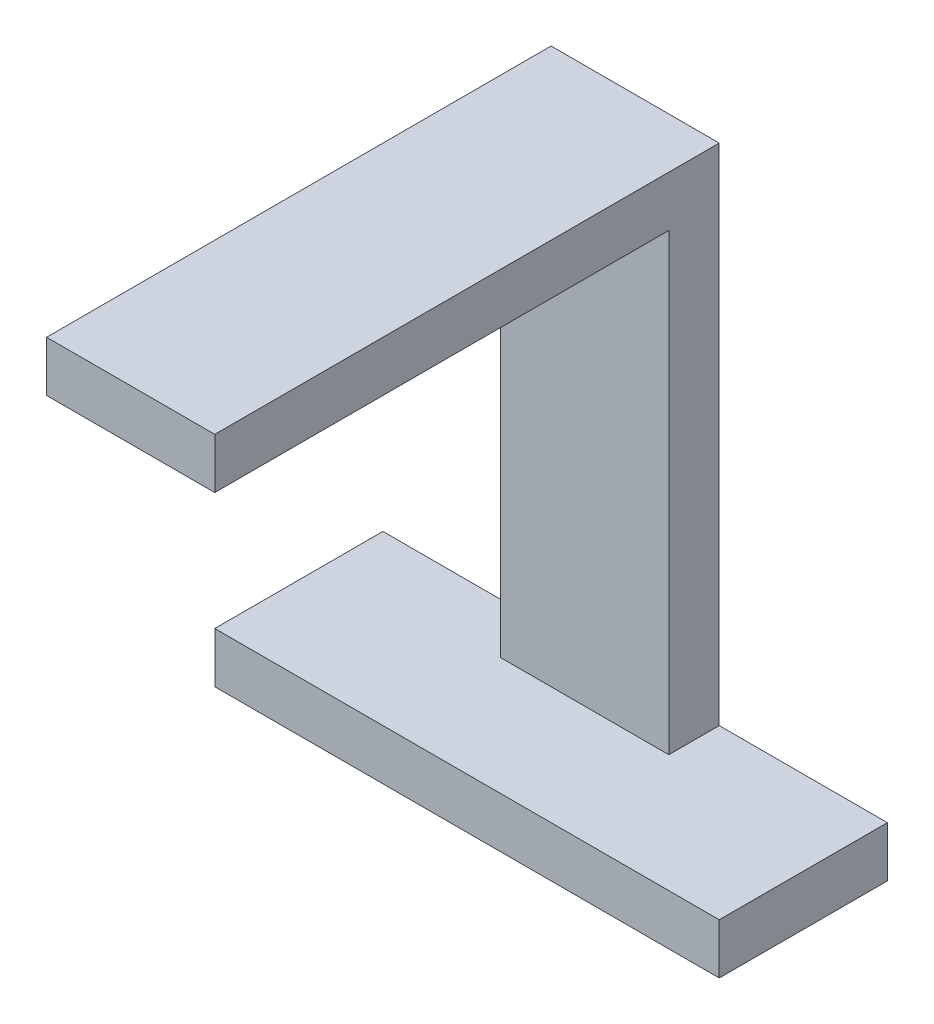
ISO-10303-21;
HEADER;
FILE_DESCRIPTION(('STEP AP214'),'2;1');
FILE_NAME('part.step','',(''),(''),'','','');
FILE_SCHEMA(('AUTOMOTIVE_DESIGN { 1 0 10303 214 1 1 1 1 }'));
ENDSEC;
DATA;
#1=APPLICATION_CONTEXT('core data for automotive mechanical design processes');
#2=APPLICATION_PROTOCOL_DEFINITION('international standard','automotive_design',2000,#1);
#3=PRODUCT_CONTEXT('',#1,'mechanical');
#4=PRODUCT('Part','Part','',(#3));
#5=PRODUCT_RELATED_PRODUCT_CATEGORY('part','',(#4));
#6=PRODUCT_DEFINITION_FORMATION('','',#4);
#7=PRODUCT_DEFINITION_CONTEXT('part definition',#1,'design');
#8=PRODUCT_DEFINITION('design','',#6,#7);
#9=PRODUCT_DEFINITION_SHAPE('','',#8);
#10=(LENGTH_UNIT() NAMED_UNIT(*) SI_UNIT(.MILLI.,.METRE.));
#11=(NAMED_UNIT(*) PLANE_ANGLE_UNIT() SI_UNIT($,.RADIAN.));
#12=(NAMED_UNIT(*) SI_UNIT($,.STERADIAN.) SOLID_ANGLE_UNIT());
#13=UNCERTAINTY_MEASURE_WITH_UNIT(LENGTH_MEASURE(1.E-05),#10,'distance_accuracy_value','');
#14=(GEOMETRIC_REPRESENTATION_CONTEXT(3) GLOBAL_UNCERTAINTY_ASSIGNED_CONTEXT((#13)) GLOBAL_UNIT_ASSIGNED_CONTEXT((#10,
#11,#12)) REPRESENTATION_CONTEXT('',''));
#15=CARTESIAN_POINT('',(0.,0.,0.));
#16=DIRECTION('',(0.,0.,1.));
#17=DIRECTION('',(1.,0.,0.));
#18=AXIS2_PLACEMENT_3D('',#15,#16,#17);
#19=CARTESIAN_POINT('',(10.,47.7502266804377,15.3509515028396));
#20=DIRECTION('',(0.,0.,-1.));
#21=DIRECTION('',(-1.,0.,0.));
#22=AXIS2_PLACEMENT_3D('',#19,#20,#21);
#23=PLANE('',#22);
#24=DIRECTION('',(0.,-1.,0.));
#25=VECTOR('',#24,1.);
#26=CARTESIAN_POINT('',(0.,47.7502266804377,15.3509515028396));
#27=LINE('',#26,#25);
#28=CARTESIAN_POINT('',(0.,50.7489467775556,15.3509515028396));
#29=VERTEX_POINT('',#28);
#30=CARTESIAN_POINT('',(0.,47.7502266804377,15.3509515028396));
#31=VERTEX_POINT('',#30);
#32=EDGE_CURVE('E139',#29,#31,#27,.T.);
#33=ORIENTED_EDGE('',*,*,#32,.T.);
#34=DIRECTION('',(-1.,0.,0.));
#35=VECTOR('',#34,1.);
#36=CARTESIAN_POINT('',(10.,47.7502266804377,15.3509515028396));
#37=LINE('',#36,#35);
#38=CARTESIAN_POINT('',(10.,47.7502266804377,15.3509515028396));
#39=VERTEX_POINT('',#38);
#40=EDGE_CURVE('E11',#39,#31,#37,.T.);
#41=ORIENTED_EDGE('',*,*,#40,.F.);
#42=DIRECTION('',(0.,-1.,0.));
#43=VECTOR('',#42,1.);
#44=CARTESIAN_POINT('',(10.,47.7502266804377,15.3509515028396));
#45=LINE('',#44,#43);
#46=CARTESIAN_POINT('',(10.,50.7489467775556,15.3509515028396));
#47=VERTEX_POINT('',#46);
#48=EDGE_CURVE('E140',#47,#39,#45,.T.);
#49=ORIENTED_EDGE('',*,*,#48,.F.);
#50=DIRECTION('',(-1.,0.,0.));
#51=VECTOR('',#50,1.);
#52=CARTESIAN_POINT('',(10.,50.7489467775556,15.3509515028396));
#53=LINE('',#52,#51);
#54=EDGE_CURVE('E145',#47,#29,#53,.T.);
#55=ORIENTED_EDGE('',*,*,#54,.T.);
#56=EDGE_LOOP('',(#33,#41,#49,#55));
#57=FACE_BOUND('',#56,.T.);
#58=ADVANCED_FACE('F35',(#57),#23,.F.);
#59=CARTESIAN_POINT('',(10.,47.7502266804377,-11.6490484971604));
#60=DIRECTION('',(0.,1.,0.));
#61=DIRECTION('',(0.,0.,1.));
#62=AXIS2_PLACEMENT_3D('',#59,#60,#61);
#63=PLANE('',#62);
#64=DIRECTION('',(0.,0.,-1.));
#65=VECTOR('',#64,1.);
#66=CARTESIAN_POINT('',(0.,47.7502266804377,-11.6490484971604));
#67=LINE('',#66,#65);
#68=CARTESIAN_POINT('',(0.,47.7502266804377,-11.6490484971604));
#69=VERTEX_POINT('',#68);
#70=EDGE_CURVE('E148',#31,#69,#67,.T.);
#71=ORIENTED_EDGE('',*,*,#70,.T.);
#72=DIRECTION('',(-1.,0.,0.));
#73=VECTOR('',#72,1.);
#74=CARTESIAN_POINT('',(10.,47.7502266804377,-11.6490484971604));
#75=LINE('',#74,#73);
#76=CARTESIAN_POINT('',(10.,47.7502266804377,-11.6490484971604));
#77=VERTEX_POINT('',#76);
#78=EDGE_CURVE('E43',#77,#69,#75,.T.);
#79=ORIENTED_EDGE('',*,*,#78,.F.);
#80=DIRECTION('',(0.,0.,-1.));
#81=VECTOR('',#80,1.);
#82=CARTESIAN_POINT('',(10.,47.7502266804377,-11.6490484971604));
#83=LINE('',#82,#81);
#84=EDGE_CURVE('E85',#39,#77,#83,.T.);
#85=ORIENTED_EDGE('',*,*,#84,.F.);
#86=ORIENTED_EDGE('',*,*,#40,.T.);
#87=EDGE_LOOP('',(#71,#79,#85,#86));
#88=FACE_BOUND('',#87,.T.);
#89=ADVANCED_FACE('F222',(#88),#63,.F.);
#90=CARTESIAN_POINT('',(10.,20.7489467775556,-11.6490484971604));
#91=DIRECTION('',(0.,0.,-1.));
#92=DIRECTION('',(-1.,0.,0.));
#93=AXIS2_PLACEMENT_3D('',#90,#91,#92);
#94=PLANE('',#93);
#95=DIRECTION('',(0.,-1.,0.));
#96=VECTOR('',#95,1.);
#97=CARTESIAN_POINT('',(0.,20.7489467775556,-11.6490484971604));
#98=LINE('',#97,#96);
#99=CARTESIAN_POINT('',(0.,20.7489467775556,-11.6490484971604));
#100=VERTEX_POINT('',#99);
#101=EDGE_CURVE('E150',#69,#100,#98,.T.);
#102=ORIENTED_EDGE('',*,*,#101,.T.);
#103=DIRECTION('',(-1.,0.,0.));
#104=VECTOR('',#103,1.);
#105=CARTESIAN_POINT('',(10.,20.7489467775556,-11.6490484971604));
#106=LINE('',#105,#104);
#107=CARTESIAN_POINT('',(10.,20.7489467775556,-11.6490484971604));
#108=VERTEX_POINT('',#107);
#109=EDGE_CURVE('E160',#108,#100,#106,.T.);
#110=ORIENTED_EDGE('',*,*,#109,.F.);
#111=DIRECTION('',(0.,-1.,0.));
#112=VECTOR('',#111,1.);
#113=CARTESIAN_POINT('',(10.,20.7489467775556,-11.6490484971604));
#114=LINE('',#113,#112);
#115=EDGE_CURVE('E99',#77,#108,#114,.T.);
#116=ORIENTED_EDGE('',*,*,#115,.F.);
#117=ORIENTED_EDGE('',*,*,#78,.T.);
#118=EDGE_LOOP('',(#102,#110,#116,#117));
#119=FACE_BOUND('',#118,.T.);
#120=ADVANCED_FACE('F164',(#119),#94,.F.);
#121=CARTESIAN_POINT('',(10.,50.7489467775556,-14.6490484971604));
#122=DIRECTION('',(0.,0.,1.));
#123=DIRECTION('',(1.,0.,0.));
#124=AXIS2_PLACEMENT_3D('',#121,#122,#123);
#125=PLANE('',#124);
#126=DIRECTION('',(0.,1.,0.));
#127=VECTOR('',#126,1.);
#128=CARTESIAN_POINT('',(0.,50.7489467775556,-14.6490484971604));
#129=LINE('',#128,#127);
#130=CARTESIAN_POINT('',(0.,20.7489467775556,-14.6490484971604));
#131=VERTEX_POINT('',#130);
#132=CARTESIAN_POINT('',(0.,50.7489467775556,-14.6490484971604));
#133=VERTEX_POINT('',#132);
#134=EDGE_CURVE('E71',#131,#133,#129,.T.);
#135=ORIENTED_EDGE('',*,*,#134,.T.);
#136=DIRECTION('',(-1.,0.,0.));
#137=VECTOR('',#136,1.);
#138=CARTESIAN_POINT('',(10.,50.7489467775556,-14.6490484971604));
#139=LINE('',#138,#137);
#140=CARTESIAN_POINT('',(10.,50.7489467775556,-14.6490484971604));
#141=VERTEX_POINT('',#140);
#142=EDGE_CURVE('E111',#141,#133,#139,.T.);
#143=ORIENTED_EDGE('',*,*,#142,.F.);
#144=DIRECTION('',(0.,1.,0.));
#145=VECTOR('',#144,1.);
#146=CARTESIAN_POINT('',(10.,50.7489467775556,-14.6490484971604));
#147=LINE('',#146,#145);
#148=CARTESIAN_POINT('',(10.,20.7489467775556,-14.6490484971604));
#149=VERTEX_POINT('',#148);
#150=EDGE_CURVE('E97',#149,#141,#147,.T.);
#151=ORIENTED_EDGE('',*,*,#150,.F.);
#152=DIRECTION('',(1.,0.,0.));
#153=VECTOR('',#152,1.);
#154=CARTESIAN_POINT('',(10.,20.7489467775556,-14.6490484971604));
#155=LINE('',#154,#153);
#156=CARTESIAN_POINT('',(20.,20.7489467775556,-14.6490484971604));
#157=VERTEX_POINT('',#156);
#158=EDGE_CURVE('E109',#149,#157,#155,.T.);
#159=ORIENTED_EDGE('',*,*,#158,.T.);
#160=DIRECTION('',(0.,1.,0.));
#161=VECTOR('',#160,1.);
#162=CARTESIAN_POINT('',(20.,17.7489467775556,-14.6490484971604));
#163=LINE('',#162,#161);
#164=CARTESIAN_POINT('',(20.,17.7489467775556,-14.6490484971604));
#165=VERTEX_POINT('',#164);
#166=EDGE_CURVE('E137',#165,#157,#163,.T.);
#167=ORIENTED_EDGE('',*,*,#166,.F.);
#168=DIRECTION('',(1.,0.,0.));
#169=VECTOR('',#168,1.);
#170=CARTESIAN_POINT('',(20.,17.7489467775556,-14.6490484971604));
#171=LINE('',#170,#169);
#172=CARTESIAN_POINT('',(-10.,17.7489467775556,-14.6490484971604));
#173=VERTEX_POINT('',#172);
#174=EDGE_CURVE('E121',#173,#165,#171,.T.);
#175=ORIENTED_EDGE('',*,*,#174,.F.);
#176=DIRECTION('',(0.,1.,0.));
#177=VECTOR('',#176,1.);
#178=CARTESIAN_POINT('',(-10.,17.7489467775556,-14.6490484971604));
#179=LINE('',#178,#177);
#180=CARTESIAN_POINT('',(-10.,20.7489467775556,-14.6490484971604));
#181=VERTEX_POINT('',#180);
#182=EDGE_CURVE('E127',#173,#181,#179,.T.);
#183=ORIENTED_EDGE('',*,*,#182,.T.);
#184=EDGE_CURVE('E118',#181,#131,#155,.T.);
#185=ORIENTED_EDGE('',*,*,#184,.T.);
#186=EDGE_LOOP('',(#135,#143,#151,#159,#167,#175,#183,#185));
#187=FACE_BOUND('',#186,.T.);
#188=ADVANCED_FACE('F106',(#187),#125,.F.);
#189=CARTESIAN_POINT('',(10.,50.7489467775556,15.3509515028396));
#190=DIRECTION('',(0.,-1.,0.));
#191=DIRECTION('',(0.,0.,-1.));
#192=AXIS2_PLACEMENT_3D('',#189,#190,#191);
#193=PLANE('',#192);
#194=DIRECTION('',(0.,0.,1.));
#195=VECTOR('',#194,1.);
#196=CARTESIAN_POINT('',(0.,50.7489467775556,15.3509515028396));
#197=LINE('',#196,#195);
#198=EDGE_CURVE('E77',#133,#29,#197,.T.);
#199=ORIENTED_EDGE('',*,*,#198,.T.);
#200=ORIENTED_EDGE('',*,*,#54,.F.);
#201=DIRECTION('',(0.,0.,1.));
#202=VECTOR('',#201,1.);
#203=CARTESIAN_POINT('',(10.,50.7489467775556,15.3509515028396));
#204=LINE('',#203,#202);
#205=EDGE_CURVE('E51',#141,#47,#204,.T.);
#206=ORIENTED_EDGE('',*,*,#205,.F.);
#207=ORIENTED_EDGE('',*,*,#142,.T.);
#208=EDGE_LOOP('',(#199,#200,#206,#207));
#209=FACE_BOUND('',#208,.T.);
#210=ADVANCED_FACE('F229',(#209),#193,.F.);
#211=CARTESIAN_POINT('',(10.,0.,0.));
#212=DIRECTION('',(-1.,0.,0.));
#213=DIRECTION('',(0.,0.,1.));
#214=AXIS2_PLACEMENT_3D('',#211,#212,#213);
#215=PLANE('',#214);
#216=ORIENTED_EDGE('',*,*,#48,.T.);
#217=ORIENTED_EDGE('',*,*,#84,.T.);
#218=ORIENTED_EDGE('',*,*,#115,.T.);
#219=DIRECTION('',(0.,0.,-1.));
#220=VECTOR('',#219,1.);
#221=CARTESIAN_POINT('',(10.,20.7489467775556,-14.6490484971604));
#222=LINE('',#221,#220);
#223=EDGE_CURVE('E94',#108,#149,#222,.T.);
#224=ORIENTED_EDGE('',*,*,#223,.T.);
#225=ORIENTED_EDGE('',*,*,#150,.T.);
#226=ORIENTED_EDGE('',*,*,#205,.T.);
#227=EDGE_LOOP('',(#216,#217,#218,#224,#225,#226));
#228=FACE_BOUND('',#227,.T.);
#229=ADVANCED_FACE('F96',(#228),#215,.F.);
#230=CARTESIAN_POINT('',(0.,0.,0.));
#231=DIRECTION('',(-1.,0.,0.));
#232=DIRECTION('',(0.,0.,1.));
#233=AXIS2_PLACEMENT_3D('',#230,#231,#232);
#234=PLANE('',#233);
#235=ORIENTED_EDGE('',*,*,#32,.F.);
#236=ORIENTED_EDGE('',*,*,#198,.F.);
#237=ORIENTED_EDGE('',*,*,#134,.F.);
#238=DIRECTION('',(0.,0.,-1.));
#239=VECTOR('',#238,1.);
#240=CARTESIAN_POINT('',(0.,20.7489467775556,-14.6490484971604));
#241=LINE('',#240,#239);
#242=EDGE_CURVE('E153',#100,#131,#241,.T.);
#243=ORIENTED_EDGE('',*,*,#242,.F.);
#244=ORIENTED_EDGE('',*,*,#101,.F.);
#245=ORIENTED_EDGE('',*,*,#70,.F.);
#246=EDGE_LOOP('',(#235,#236,#237,#243,#244,#245));
#247=FACE_BOUND('',#246,.T.);
#248=ADVANCED_FACE('F168',(#247),#234,.T.);
#249=CARTESIAN_POINT('',(20.,17.7489467775556,-4.64904849716036));
#250=DIRECTION('',(-1.,0.,0.));
#251=DIRECTION('',(0.,0.,1.));
#252=AXIS2_PLACEMENT_3D('',#249,#250,#251);
#253=PLANE('',#252);
#254=DIRECTION('',(0.,0.,1.));
#255=VECTOR('',#254,1.);
#256=CARTESIAN_POINT('',(20.,20.7489467775556,-4.64904849716036));
#257=LINE('',#256,#255);
#258=CARTESIAN_POINT('',(20.,20.7489467775556,-4.64904849716036));
#259=VERTEX_POINT('',#258);
#260=EDGE_CURVE('E116',#157,#259,#257,.T.);
#261=ORIENTED_EDGE('',*,*,#260,.T.);
#262=DIRECTION('',(0.,1.,0.));
#263=VECTOR('',#262,1.);
#264=CARTESIAN_POINT('',(20.,17.7489467775556,-4.64904849716036));
#265=LINE('',#264,#263);
#266=CARTESIAN_POINT('',(20.,17.7489467775556,-4.64904849716036));
#267=VERTEX_POINT('',#266);
#268=EDGE_CURVE('E134',#267,#259,#265,.T.);
#269=ORIENTED_EDGE('',*,*,#268,.F.);
#270=DIRECTION('',(0.,0.,1.));
#271=VECTOR('',#270,1.);
#272=CARTESIAN_POINT('',(20.,17.7489467775556,-4.64904849716036));
#273=LINE('',#272,#271);
#274=EDGE_CURVE('E203',#165,#267,#273,.T.);
#275=ORIENTED_EDGE('',*,*,#274,.F.);
#276=ORIENTED_EDGE('',*,*,#166,.T.);
#277=EDGE_LOOP('',(#261,#269,#275,#276));
#278=FACE_BOUND('',#277,.T.);
#279=ADVANCED_FACE('F211',(#278),#253,.F.);
#280=CARTESIAN_POINT('',(-10.,17.7489467775556,-4.64904849716037));
#281=DIRECTION('',(0.,0.,-1.));
#282=DIRECTION('',(-1.,0.,0.));
#283=AXIS2_PLACEMENT_3D('',#280,#281,#282);
#284=PLANE('',#283);
#285=DIRECTION('',(-1.,0.,0.));
#286=VECTOR('',#285,1.);
#287=CARTESIAN_POINT('',(-10.,20.7489467775556,-4.64904849716037));
#288=LINE('',#287,#286);
#289=CARTESIAN_POINT('',(-10.,20.7489467775556,-4.64904849716037));
#290=VERTEX_POINT('',#289);
#291=EDGE_CURVE('E123',#259,#290,#288,.T.);
#292=ORIENTED_EDGE('',*,*,#291,.T.);
#293=DIRECTION('',(0.,1.,0.));
#294=VECTOR('',#293,1.);
#295=CARTESIAN_POINT('',(-10.,17.7489467775556,-4.64904849716037));
#296=LINE('',#295,#294);
#297=CARTESIAN_POINT('',(-10.,17.7489467775556,-4.64904849716037));
#298=VERTEX_POINT('',#297);
#299=EDGE_CURVE('E130',#298,#290,#296,.T.);
#300=ORIENTED_EDGE('',*,*,#299,.F.);
#301=DIRECTION('',(-1.,0.,0.));
#302=VECTOR('',#301,1.);
#303=CARTESIAN_POINT('',(10.,17.7489467775556,-4.64904849716036));
#304=LINE('',#303,#302);
#305=EDGE_CURVE('E201',#267,#298,#304,.T.);
#306=ORIENTED_EDGE('',*,*,#305,.F.);
#307=ORIENTED_EDGE('',*,*,#268,.T.);
#308=EDGE_LOOP('',(#292,#300,#306,#307));
#309=FACE_BOUND('',#308,.T.);
#310=ADVANCED_FACE('F195',(#309),#284,.F.);
#311=CARTESIAN_POINT('',(-10.,17.7489467775556,-14.6490484971604));
#312=DIRECTION('',(1.,0.,0.));
#313=DIRECTION('',(0.,0.,-1.));
#314=AXIS2_PLACEMENT_3D('',#311,#312,#313);
#315=PLANE('',#314);
#316=DIRECTION('',(0.,0.,-1.));
#317=VECTOR('',#316,1.);
#318=CARTESIAN_POINT('',(-10.,20.7489467775556,-14.6490484971604));
#319=LINE('',#318,#317);
#320=EDGE_CURVE('E119',#290,#181,#319,.T.);
#321=ORIENTED_EDGE('',*,*,#320,.T.);
#322=ORIENTED_EDGE('',*,*,#182,.F.);
#323=DIRECTION('',(0.,0.,-1.));
#324=VECTOR('',#323,1.);
#325=CARTESIAN_POINT('',(-10.,17.7489467775556,-14.6490484971604));
#326=LINE('',#325,#324);
#327=EDGE_CURVE('E131',#298,#173,#326,.T.);
#328=ORIENTED_EDGE('',*,*,#327,.F.);
#329=ORIENTED_EDGE('',*,*,#299,.T.);
#330=EDGE_LOOP('',(#321,#322,#328,#329));
#331=FACE_BOUND('',#330,.T.);
#332=ADVANCED_FACE('F181',(#331),#315,.F.);
#333=CARTESIAN_POINT('',(0.,17.7489467775556,0.));
#334=DIRECTION('',(0.,1.,0.));
#335=DIRECTION('',(0.,0.,1.));
#336=AXIS2_PLACEMENT_3D('',#333,#334,#335);
#337=PLANE('',#336);
#338=ORIENTED_EDGE('',*,*,#174,.T.);
#339=ORIENTED_EDGE('',*,*,#274,.T.);
#340=ORIENTED_EDGE('',*,*,#305,.T.);
#341=ORIENTED_EDGE('',*,*,#327,.T.);
#342=EDGE_LOOP('',(#338,#339,#340,#341));
#343=FACE_BOUND('',#342,.T.);
#344=ADVANCED_FACE('F207',(#343),#337,.F.);
#345=CARTESIAN_POINT('',(0.,20.7489467775556,0.));
#346=DIRECTION('',(0.,1.,0.));
#347=DIRECTION('',(0.,0.,1.));
#348=AXIS2_PLACEMENT_3D('',#345,#346,#347);
#349=PLANE('',#348);
#350=ORIENTED_EDGE('',*,*,#109,.T.);
#351=ORIENTED_EDGE('',*,*,#242,.T.);
#352=ORIENTED_EDGE('',*,*,#184,.F.);
#353=ORIENTED_EDGE('',*,*,#320,.F.);
#354=ORIENTED_EDGE('',*,*,#291,.F.);
#355=ORIENTED_EDGE('',*,*,#260,.F.);
#356=ORIENTED_EDGE('',*,*,#158,.F.);
#357=ORIENTED_EDGE('',*,*,#223,.F.);
#358=EDGE_LOOP('',(#350,#351,#352,#353,#354,#355,#356,#357));
#359=FACE_BOUND('',#358,.T.);
#360=ADVANCED_FACE('F113',(#359),#349,.T.);
#361=CLOSED_SHELL('',(#58,#89,#120,#188,#210,#229,#248,#279,#310,#332,#344,#360));
#362=MANIFOLD_SOLID_BREP('B2',#361);
#363=ADVANCED_BREP_SHAPE_REPRESENTATION('',(#18,#362),#14);
#364=SHAPE_DEFINITION_REPRESENTATION(#9,#363);
ENDSEC;
END-ISO-10303-21;
